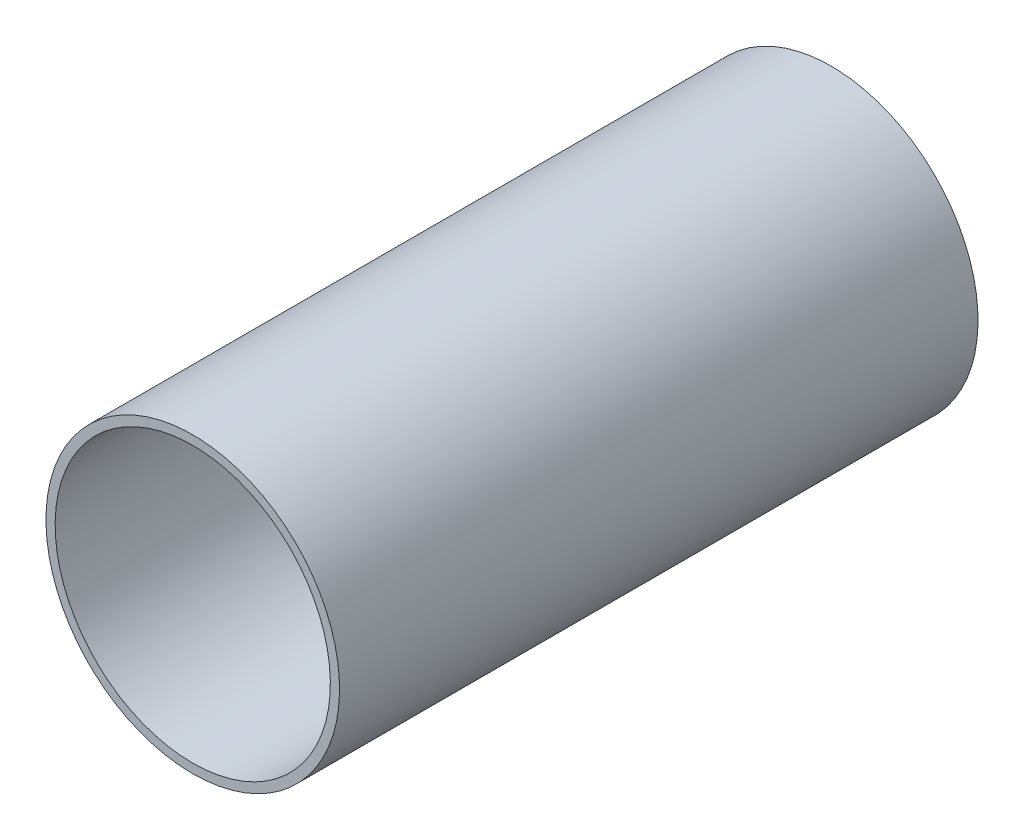
ISO-10303-21;
HEADER;
FILE_DESCRIPTION(('STEP AP214'),'2;1');
FILE_NAME('part.step','',(''),(''),'','','');
FILE_SCHEMA(('AUTOMOTIVE_DESIGN { 1 0 10303 214 1 1 1 1 }'));
ENDSEC;
DATA;
#1=APPLICATION_CONTEXT('core data for automotive mechanical design processes');
#2=APPLICATION_PROTOCOL_DEFINITION('international standard','automotive_design',2000,#1);
#3=PRODUCT_CONTEXT('',#1,'mechanical');
#4=PRODUCT('Part','Part','',(#3));
#5=PRODUCT_RELATED_PRODUCT_CATEGORY('part','',(#4));
#6=PRODUCT_DEFINITION_FORMATION('','',#4);
#7=PRODUCT_DEFINITION_CONTEXT('part definition',#1,'design');
#8=PRODUCT_DEFINITION('design','',#6,#7);
#9=PRODUCT_DEFINITION_SHAPE('','',#8);
#10=(LENGTH_UNIT() NAMED_UNIT(*) SI_UNIT(.MILLI.,.METRE.));
#11=(NAMED_UNIT(*) PLANE_ANGLE_UNIT() SI_UNIT($,.RADIAN.));
#12=(NAMED_UNIT(*) SI_UNIT($,.STERADIAN.) SOLID_ANGLE_UNIT());
#13=UNCERTAINTY_MEASURE_WITH_UNIT(LENGTH_MEASURE(1.E-05),#10,'distance_accuracy_value','');
#14=(GEOMETRIC_REPRESENTATION_CONTEXT(3) GLOBAL_UNCERTAINTY_ASSIGNED_CONTEXT((#13)) GLOBAL_UNIT_ASSIGNED_CONTEXT((#10,
#11,#12)) REPRESENTATION_CONTEXT('',''));
#15=CARTESIAN_POINT('',(0.,0.,0.));
#16=DIRECTION('',(0.,0.,1.));
#17=DIRECTION('',(1.,0.,0.));
#18=AXIS2_PLACEMENT_3D('',#15,#16,#17);
#19=CARTESIAN_POINT('',(170.18,-120.396,-0.045));
#20=DIRECTION('',(0.,0.,-1.));
#21=DIRECTION('',(0.,-1.,0.));
#22=AXIS2_PLACEMENT_3D('',#19,#20,#21);
#23=CYLINDRICAL_SURFACE('',#22,0.375);
#24=CARTESIAN_POINT('',(170.18,-120.396,-0.035));
#25=DIRECTION('',(0.,0.,-1.));
#26=DIRECTION('',(0.,-1.,0.));
#27=AXIS2_PLACEMENT_3D('',#24,#25,#26);
#28=CIRCLE('',#27,0.375);
#29=CARTESIAN_POINT('',(170.18,-120.771,-0.035));
#30=VERTEX_POINT('',#29);
#31=EDGE_CURVE('E64',#30,#30,#28,.T.);
#32=ORIENTED_EDGE('',*,*,#31,.T.);
#33=DIRECTION('',(0.,0.,1.));
#34=VECTOR('',#33,1.);
#35=CARTESIAN_POINT('',(170.18,-120.771,-0.045));
#36=LINE('',#35,#34);
#37=CARTESIAN_POINT('',(170.18,-120.771,1.705));
#38=VERTEX_POINT('',#37);
#39=EDGE_CURVE('E11',#30,#38,#36,.T.);
#40=ORIENTED_EDGE('',*,*,#39,.T.);
#41=CARTESIAN_POINT('',(170.18,-120.396,1.705));
#42=DIRECTION('',(0.,0.,-1.));
#43=DIRECTION('',(0.,-1.,0.));
#44=AXIS2_PLACEMENT_3D('',#41,#42,#43);
#45=CIRCLE('',#44,0.375);
#46=EDGE_CURVE('E25',#38,#38,#45,.T.);
#47=ORIENTED_EDGE('',*,*,#46,.F.);
#48=ORIENTED_EDGE('',*,*,#39,.F.);
#49=EDGE_LOOP('',(#32,#40,#47,#48));
#50=FACE_BOUND('',#49,.T.);
#51=ADVANCED_FACE('F17',(#50),#23,.F.);
#52=CARTESIAN_POINT('',(170.18,-120.796,1.705));
#53=DIRECTION('',(0.,0.,1.));
#54=DIRECTION('',(1.,0.,0.));
#55=AXIS2_PLACEMENT_3D('',#52,#53,#54);
#56=PLANE('',#55);
#57=ORIENTED_EDGE('',*,*,#46,.T.);
#58=EDGE_LOOP('',(#57));
#59=FACE_BOUND('',#58,.T.);
#60=CARTESIAN_POINT('',(170.18,-120.396,1.705));
#61=DIRECTION('',(0.,0.,1.));
#62=DIRECTION('',(0.,-1.,0.));
#63=AXIS2_PLACEMENT_3D('',#60,#61,#62);
#64=CIRCLE('',#63,0.4);
#65=CARTESIAN_POINT('',(170.18,-120.796,1.705));
#66=VERTEX_POINT('',#65);
#67=EDGE_CURVE('E56',#66,#66,#64,.T.);
#68=ORIENTED_EDGE('',*,*,#67,.T.);
#69=EDGE_LOOP('',(#68));
#70=FACE_BOUND('',#69,.T.);
#71=ADVANCED_FACE('F73',(#59,#70),#56,.T.);
#72=CARTESIAN_POINT('',(170.18,-120.796,-0.035));
#73=DIRECTION('',(0.,0.,1.));
#74=DIRECTION('',(1.,0.,0.));
#75=AXIS2_PLACEMENT_3D('',#72,#73,#74);
#76=PLANE('',#75);
#77=ORIENTED_EDGE('',*,*,#31,.F.);
#78=EDGE_LOOP('',(#77));
#79=FACE_BOUND('',#78,.T.);
#80=CARTESIAN_POINT('',(170.18,-120.396,-0.035));
#81=DIRECTION('',(0.,0.,1.));
#82=DIRECTION('',(0.,-1.,0.));
#83=AXIS2_PLACEMENT_3D('',#80,#81,#82);
#84=CIRCLE('',#83,0.4);
#85=CARTESIAN_POINT('',(170.18,-120.796,-0.035));
#86=VERTEX_POINT('',#85);
#87=EDGE_CURVE('E55',#86,#86,#84,.T.);
#88=ORIENTED_EDGE('',*,*,#87,.F.);
#89=EDGE_LOOP('',(#88));
#90=FACE_BOUND('',#89,.T.);
#91=ADVANCED_FACE('F82',(#79,#90),#76,.F.);
#92=CARTESIAN_POINT('',(170.18,-120.396,-0.035));
#93=DIRECTION('',(0.,0.,-1.));
#94=DIRECTION('',(0.,-1.,0.));
#95=AXIS2_PLACEMENT_3D('',#92,#93,#94);
#96=CYLINDRICAL_SURFACE('',#95,0.4);
#97=ORIENTED_EDGE('',*,*,#87,.T.);
#98=DIRECTION('',(0.,0.,1.));
#99=VECTOR('',#98,1.);
#100=CARTESIAN_POINT('',(170.18,-120.796,-0.035));
#101=LINE('',#100,#99);
#102=EDGE_CURVE('E52',#86,#66,#101,.T.);
#103=ORIENTED_EDGE('',*,*,#102,.T.);
#104=ORIENTED_EDGE('',*,*,#67,.F.);
#105=ORIENTED_EDGE('',*,*,#102,.F.);
#106=EDGE_LOOP('',(#97,#103,#104,#105));
#107=FACE_BOUND('',#106,.T.);
#108=ADVANCED_FACE('F53',(#107),#96,.T.);
#109=CLOSED_SHELL('',(#51,#71,#91,#108));
#110=MANIFOLD_SOLID_BREP('B1',#109);
#111=ADVANCED_BREP_SHAPE_REPRESENTATION('',(#18,#110),#14);
#112=SHAPE_DEFINITION_REPRESENTATION(#9,#111);
ENDSEC;
END-ISO-10303-21;
